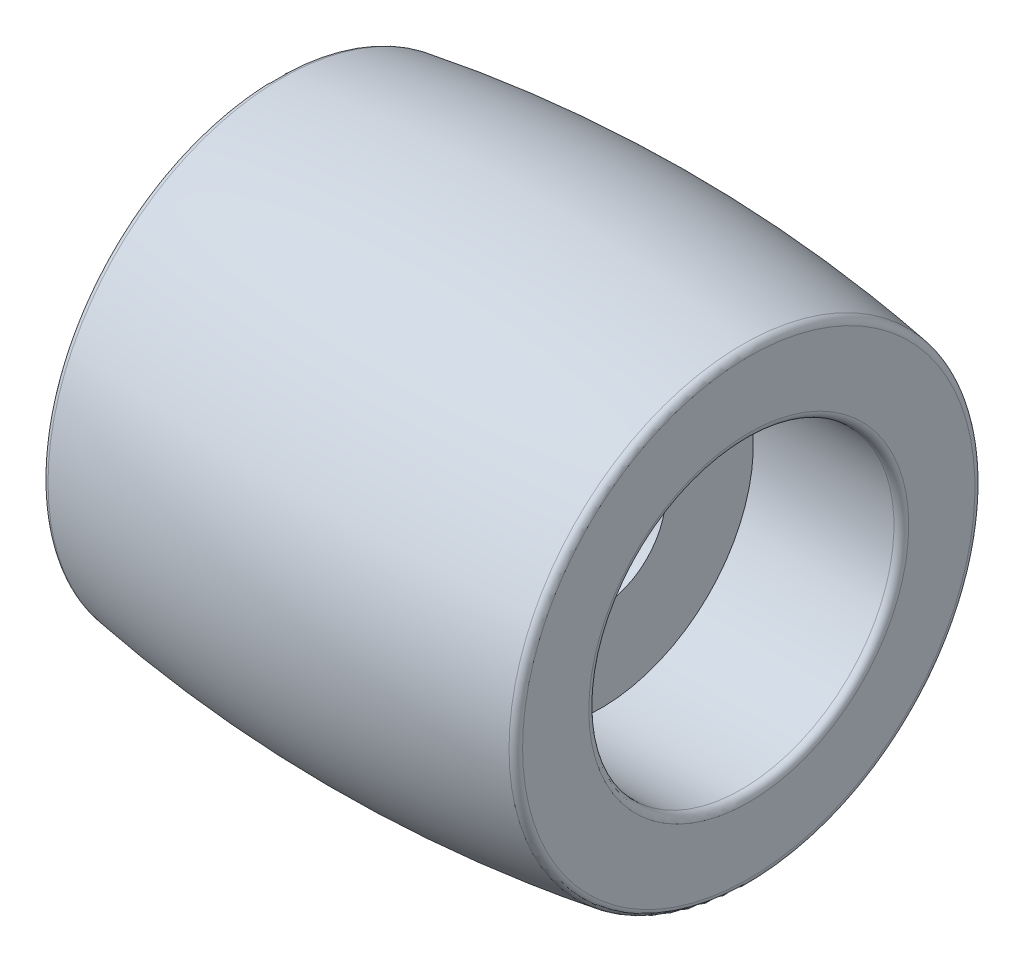
ISO-10303-21;
HEADER;
FILE_DESCRIPTION(('STEP AP214'),'2;1');
FILE_NAME('part.step','',(''),(''),'','','');
FILE_SCHEMA(('AUTOMOTIVE_DESIGN { 1 0 10303 214 1 1 1 1 }'));
ENDSEC;
DATA;
#1=APPLICATION_CONTEXT('core data for automotive mechanical design processes');
#2=APPLICATION_PROTOCOL_DEFINITION('international standard','automotive_design',2000,#1);
#3=PRODUCT_CONTEXT('',#1,'mechanical');
#4=PRODUCT('Part','Part','',(#3));
#5=PRODUCT_RELATED_PRODUCT_CATEGORY('part','',(#4));
#6=PRODUCT_DEFINITION_FORMATION('','',#4);
#7=PRODUCT_DEFINITION_CONTEXT('part definition',#1,'design');
#8=PRODUCT_DEFINITION('design','',#6,#7);
#9=PRODUCT_DEFINITION_SHAPE('','',#8);
#10=(LENGTH_UNIT() NAMED_UNIT(*) SI_UNIT(.MILLI.,.METRE.));
#11=(NAMED_UNIT(*) PLANE_ANGLE_UNIT() SI_UNIT($,.RADIAN.));
#12=(NAMED_UNIT(*) SI_UNIT($,.STERADIAN.) SOLID_ANGLE_UNIT());
#13=UNCERTAINTY_MEASURE_WITH_UNIT(LENGTH_MEASURE(1.E-05),#10,'distance_accuracy_value','');
#14=(GEOMETRIC_REPRESENTATION_CONTEXT(3) GLOBAL_UNCERTAINTY_ASSIGNED_CONTEXT((#13)) GLOBAL_UNIT_ASSIGNED_CONTEXT((#10,
#11,#12)) REPRESENTATION_CONTEXT('',''));
#15=CARTESIAN_POINT('',(0.,0.,0.));
#16=DIRECTION('',(0.,0.,1.));
#17=DIRECTION('',(1.,0.,0.));
#18=AXIS2_PLACEMENT_3D('',#15,#16,#17);
#19=CARTESIAN_POINT('',(0.,0.,0.));
#20=DIRECTION('',(-1.,0.,0.));
#21=DIRECTION('',(0.,0.,1.));
#22=AXIS2_PLACEMENT_3D('',#19,#20,#21);
#23=DEGENERATE_TOROIDAL_SURFACE('',#22,41.5,50.,.F.);
#24=CARTESIAN_POINT('',(-7.78894472361809,0.,0.));
#25=DIRECTION('',(1.,0.,0.));
#26=DIRECTION('',(0.,0.,-1.));
#27=AXIS2_PLACEMENT_3D('',#24,#25,#26);
#28=CIRCLE('',#27,7.88959748866579);
#29=CARTESIAN_POINT('',(-7.78894472361809,0.,-7.88959748866579));
#30=VERTEX_POINT('',#29);
#31=EDGE_CURVE('E54',#30,#30,#28,.T.);
#32=ORIENTED_EDGE('',*,*,#31,.T.);
#33=EDGE_LOOP('',(#32));
#34=FACE_BOUND('',#33,.T.);
#35=CARTESIAN_POINT('',(7.78894472361809,0.,0.));
#36=DIRECTION('',(-1.,0.,0.));
#37=DIRECTION('',(0.,0.,1.));
#38=AXIS2_PLACEMENT_3D('',#35,#36,#37);
#39=CIRCLE('',#38,7.88959748866579);
#40=CARTESIAN_POINT('',(7.78894472361809,0.,7.88959748866579));
#41=VERTEX_POINT('',#40);
#42=EDGE_CURVE('E57',#41,#41,#39,.T.);
#43=ORIENTED_EDGE('',*,*,#42,.T.);
#44=EDGE_LOOP('',(#43));
#45=FACE_BOUND('',#44,.T.);
#46=ADVANCED_FACE('F34',(#34,#45),#23,.F.);
#47=CARTESIAN_POINT('',(8.,5.15585071701227,0.));
#48=DIRECTION('',(-1.,0.,0.));
#49=DIRECTION('',(0.,0.,1.));
#50=AXIS2_PLACEMENT_3D('',#47,#48,#49);
#51=PLANE('',#50);
#52=CARTESIAN_POINT('',(8.,0.,0.));
#53=DIRECTION('',(-1.,0.,0.));
#54=DIRECTION('',(0.,0.,1.));
#55=AXIS2_PLACEMENT_3D('',#52,#53,#54);
#56=CIRCLE('',#55,5.40585071701227);
#57=CARTESIAN_POINT('',(8.,0.,5.40585071701227));
#58=VERTEX_POINT('',#57);
#59=EDGE_CURVE('E41',#58,#58,#56,.T.);
#60=ORIENTED_EDGE('',*,*,#59,.T.);
#61=EDGE_LOOP('',(#60));
#62=FACE_BOUND('',#61,.T.);
#63=CARTESIAN_POINT('',(8.,0.,0.));
#64=DIRECTION('',(-1.,0.,0.));
#65=DIRECTION('',(0.,0.,1.));
#66=AXIS2_PLACEMENT_3D('',#63,#64,#65);
#67=CIRCLE('',#66,7.64264950122246);
#68=CARTESIAN_POINT('',(8.,0.,7.64264950122246));
#69=VERTEX_POINT('',#68);
#70=EDGE_CURVE('E45',#69,#69,#67,.F.);
#71=ORIENTED_EDGE('',*,*,#70,.T.);
#72=EDGE_LOOP('',(#71));
#73=FACE_BOUND('',#72,.T.);
#74=ADVANCED_FACE('F97',(#62,#73),#51,.F.);
#75=CARTESIAN_POINT('',(-9.77367688022285,0.,0.));
#76=DIRECTION('',(-1.,0.,0.));
#77=DIRECTION('',(0.,0.,1.));
#78=AXIS2_PLACEMENT_3D('',#75,#76,#77);
#79=CYLINDRICAL_SURFACE('',#78,5.15585071701227);
#80=CARTESIAN_POINT('',(7.75,0.,0.));
#81=DIRECTION('',(-1.,0.,0.));
#82=DIRECTION('',(0.,0.,1.));
#83=AXIS2_PLACEMENT_3D('',#80,#81,#82);
#84=CIRCLE('',#83,5.15585071701227);
#85=CARTESIAN_POINT('',(7.75,0.,5.15585071701227));
#86=VERTEX_POINT('',#85);
#87=EDGE_CURVE('E10',#86,#86,#84,.F.);
#88=ORIENTED_EDGE('',*,*,#87,.T.);
#89=EDGE_LOOP('',(#88));
#90=FACE_BOUND('',#89,.T.);
#91=CARTESIAN_POINT('',(3.,0.,0.));
#92=DIRECTION('',(-1.,0.,0.));
#93=DIRECTION('',(0.,0.,1.));
#94=AXIS2_PLACEMENT_3D('',#91,#92,#93);
#95=CIRCLE('',#94,5.15585071701227);
#96=CARTESIAN_POINT('',(3.,0.,5.15585071701227));
#97=VERTEX_POINT('',#96);
#98=EDGE_CURVE('E66',#97,#97,#95,.T.);
#99=ORIENTED_EDGE('',*,*,#98,.T.);
#100=EDGE_LOOP('',(#99));
#101=FACE_BOUND('',#100,.T.);
#102=ADVANCED_FACE('F103',(#90,#101),#79,.F.);
#103=CARTESIAN_POINT('',(3.,2.2,0.));
#104=DIRECTION('',(-1.,0.,0.));
#105=DIRECTION('',(0.,0.,1.));
#106=AXIS2_PLACEMENT_3D('',#103,#104,#105);
#107=PLANE('',#106);
#108=ORIENTED_EDGE('',*,*,#98,.F.);
#109=EDGE_LOOP('',(#108));
#110=FACE_BOUND('',#109,.T.);
#111=CARTESIAN_POINT('',(3.,0.,0.));
#112=DIRECTION('',(-1.,0.,0.));
#113=DIRECTION('',(0.,0.,1.));
#114=AXIS2_PLACEMENT_3D('',#111,#112,#113);
#115=CIRCLE('',#114,2.2);
#116=CARTESIAN_POINT('',(3.,0.,2.2));
#117=VERTEX_POINT('',#116);
#118=EDGE_CURVE('E69',#117,#117,#115,.T.);
#119=ORIENTED_EDGE('',*,*,#118,.T.);
#120=EDGE_LOOP('',(#119));
#121=FACE_BOUND('',#120,.T.);
#122=ADVANCED_FACE('F164',(#110,#121),#107,.F.);
#123=CARTESIAN_POINT('',(-9.77367688022285,0.,0.));
#124=DIRECTION('',(-1.,0.,0.));
#125=DIRECTION('',(0.,0.,1.));
#126=AXIS2_PLACEMENT_3D('',#123,#124,#125);
#127=CYLINDRICAL_SURFACE('',#126,2.2);
#128=ORIENTED_EDGE('',*,*,#118,.F.);
#129=EDGE_LOOP('',(#128));
#130=FACE_BOUND('',#129,.T.);
#131=CARTESIAN_POINT('',(-3.,0.,0.));
#132=DIRECTION('',(-1.,0.,0.));
#133=DIRECTION('',(0.,0.,1.));
#134=AXIS2_PLACEMENT_3D('',#131,#132,#133);
#135=CIRCLE('',#134,2.2);
#136=CARTESIAN_POINT('',(-3.,0.,2.2));
#137=VERTEX_POINT('',#136);
#138=EDGE_CURVE('E72',#137,#137,#135,.T.);
#139=ORIENTED_EDGE('',*,*,#138,.T.);
#140=EDGE_LOOP('',(#139));
#141=FACE_BOUND('',#140,.T.);
#142=ADVANCED_FACE('F93',(#130,#141),#127,.F.);
#143=CARTESIAN_POINT('',(-3.,5.15585071701227,0.));
#144=DIRECTION('',(1.,0.,0.));
#145=DIRECTION('',(0.,0.,-1.));
#146=AXIS2_PLACEMENT_3D('',#143,#144,#145);
#147=PLANE('',#146);
#148=ORIENTED_EDGE('',*,*,#138,.F.);
#149=EDGE_LOOP('',(#148));
#150=FACE_BOUND('',#149,.T.);
#151=CARTESIAN_POINT('',(-3.,0.,0.));
#152=DIRECTION('',(-1.,0.,0.));
#153=DIRECTION('',(0.,0.,1.));
#154=AXIS2_PLACEMENT_3D('',#151,#152,#153);
#155=CIRCLE('',#154,5.15585071701227);
#156=CARTESIAN_POINT('',(-3.,0.,5.15585071701227));
#157=VERTEX_POINT('',#156);
#158=EDGE_CURVE('E75',#157,#157,#155,.T.);
#159=ORIENTED_EDGE('',*,*,#158,.T.);
#160=EDGE_LOOP('',(#159));
#161=FACE_BOUND('',#160,.T.);
#162=ADVANCED_FACE('F79',(#150,#161),#147,.F.);
#163=CARTESIAN_POINT('',(-9.77367688022285,0.,0.));
#164=DIRECTION('',(-1.,0.,0.));
#165=DIRECTION('',(0.,0.,1.));
#166=AXIS2_PLACEMENT_3D('',#163,#164,#165);
#167=CYLINDRICAL_SURFACE('',#166,5.15585071701227);
#168=CARTESIAN_POINT('',(-7.75,0.,0.));
#169=DIRECTION('',(1.,0.,0.));
#170=DIRECTION('',(0.,0.,-1.));
#171=AXIS2_PLACEMENT_3D('',#168,#169,#170);
#172=CIRCLE('',#171,5.15585071701227);
#173=CARTESIAN_POINT('',(-7.75,0.,-5.15585071701227));
#174=VERTEX_POINT('',#173);
#175=EDGE_CURVE('E49',#174,#174,#172,.F.);
#176=ORIENTED_EDGE('',*,*,#175,.T.);
#177=EDGE_LOOP('',(#176));
#178=FACE_BOUND('',#177,.T.);
#179=ORIENTED_EDGE('',*,*,#158,.F.);
#180=EDGE_LOOP('',(#179));
#181=FACE_BOUND('',#180,.T.);
#182=ADVANCED_FACE('F81',(#178,#181),#167,.F.);
#183=CARTESIAN_POINT('',(-8.,7.85585071701227,0.));
#184=DIRECTION('',(1.,0.,0.));
#185=DIRECTION('',(0.,0.,-1.));
#186=AXIS2_PLACEMENT_3D('',#183,#184,#185);
#187=PLANE('',#186);
#188=CARTESIAN_POINT('',(-8.,0.,0.));
#189=DIRECTION('',(1.,0.,0.));
#190=DIRECTION('',(0.,0.,-1.));
#191=AXIS2_PLACEMENT_3D('',#188,#189,#190);
#192=CIRCLE('',#191,7.64264950122246);
#193=CARTESIAN_POINT('',(-8.,0.,-7.64264950122246));
#194=VERTEX_POINT('',#193);
#195=EDGE_CURVE('E60',#194,#194,#192,.F.);
#196=ORIENTED_EDGE('',*,*,#195,.T.);
#197=EDGE_LOOP('',(#196));
#198=FACE_BOUND('',#197,.T.);
#199=CARTESIAN_POINT('',(-8.,0.,0.));
#200=DIRECTION('',(1.,0.,0.));
#201=DIRECTION('',(0.,0.,-1.));
#202=AXIS2_PLACEMENT_3D('',#199,#200,#201);
#203=CIRCLE('',#202,5.40585071701227);
#204=CARTESIAN_POINT('',(-8.,0.,-5.40585071701227));
#205=VERTEX_POINT('',#204);
#206=EDGE_CURVE('E63',#205,#205,#203,.T.);
#207=ORIENTED_EDGE('',*,*,#206,.T.);
#208=EDGE_LOOP('',(#207));
#209=FACE_BOUND('',#208,.T.);
#210=ADVANCED_FACE('F83',(#198,#209),#187,.F.);
#211=CARTESIAN_POINT('',(-7.75,0.,0.));
#212=DIRECTION('',(1.,0.,0.));
#213=DIRECTION('',(0.,0.,-1.));
#214=AXIS2_PLACEMENT_3D('',#211,#212,#213);
#215=TOROIDAL_SURFACE('',#214,7.64264950122246,0.25);
#216=ORIENTED_EDGE('',*,*,#31,.F.);
#217=EDGE_LOOP('',(#216));
#218=FACE_BOUND('',#217,.T.);
#219=ORIENTED_EDGE('',*,*,#195,.F.);
#220=EDGE_LOOP('',(#219));
#221=FACE_BOUND('',#220,.T.);
#222=ADVANCED_FACE('F90',(#218,#221),#215,.T.);
#223=CARTESIAN_POINT('',(-7.75,0.,0.));
#224=DIRECTION('',(1.,0.,0.));
#225=DIRECTION('',(0.,0.,-1.));
#226=AXIS2_PLACEMENT_3D('',#223,#224,#225);
#227=TOROIDAL_SURFACE('',#226,5.40585071701227,0.25);
#228=ORIENTED_EDGE('',*,*,#206,.F.);
#229=EDGE_LOOP('',(#228));
#230=FACE_BOUND('',#229,.T.);
#231=ORIENTED_EDGE('',*,*,#175,.F.);
#232=EDGE_LOOP('',(#231));
#233=FACE_BOUND('',#232,.T.);
#234=ADVANCED_FACE('F110',(#230,#233),#227,.T.);
#235=CARTESIAN_POINT('',(7.75,0.,0.));
#236=DIRECTION('',(-1.,0.,0.));
#237=DIRECTION('',(0.,0.,1.));
#238=AXIS2_PLACEMENT_3D('',#235,#236,#237);
#239=TOROIDAL_SURFACE('',#238,5.40585071701227,0.25);
#240=ORIENTED_EDGE('',*,*,#87,.F.);
#241=EDGE_LOOP('',(#240));
#242=FACE_BOUND('',#241,.T.);
#243=ORIENTED_EDGE('',*,*,#59,.F.);
#244=EDGE_LOOP('',(#243));
#245=FACE_BOUND('',#244,.T.);
#246=ADVANCED_FACE('F113',(#242,#245),#239,.T.);
#247=CARTESIAN_POINT('',(7.75,0.,0.));
#248=DIRECTION('',(-1.,0.,0.));
#249=DIRECTION('',(0.,0.,1.));
#250=AXIS2_PLACEMENT_3D('',#247,#248,#249);
#251=TOROIDAL_SURFACE('',#250,7.64264950122246,0.25);
#252=ORIENTED_EDGE('',*,*,#70,.F.);
#253=EDGE_LOOP('',(#252));
#254=FACE_BOUND('',#253,.T.);
#255=ORIENTED_EDGE('',*,*,#42,.F.);
#256=EDGE_LOOP('',(#255));
#257=FACE_BOUND('',#256,.T.);
#258=ADVANCED_FACE('F36',(#254,#257),#251,.T.);
#259=CLOSED_SHELL('',(#46,#74,#102,#122,#142,#162,#182,#210,#222,#234,#246,#258));
#260=MANIFOLD_SOLID_BREP('B2',#259);
#261=ADVANCED_BREP_SHAPE_REPRESENTATION('',(#18,#260),#14);
#262=SHAPE_DEFINITION_REPRESENTATION(#9,#261);
ENDSEC;
END-ISO-10303-21;
